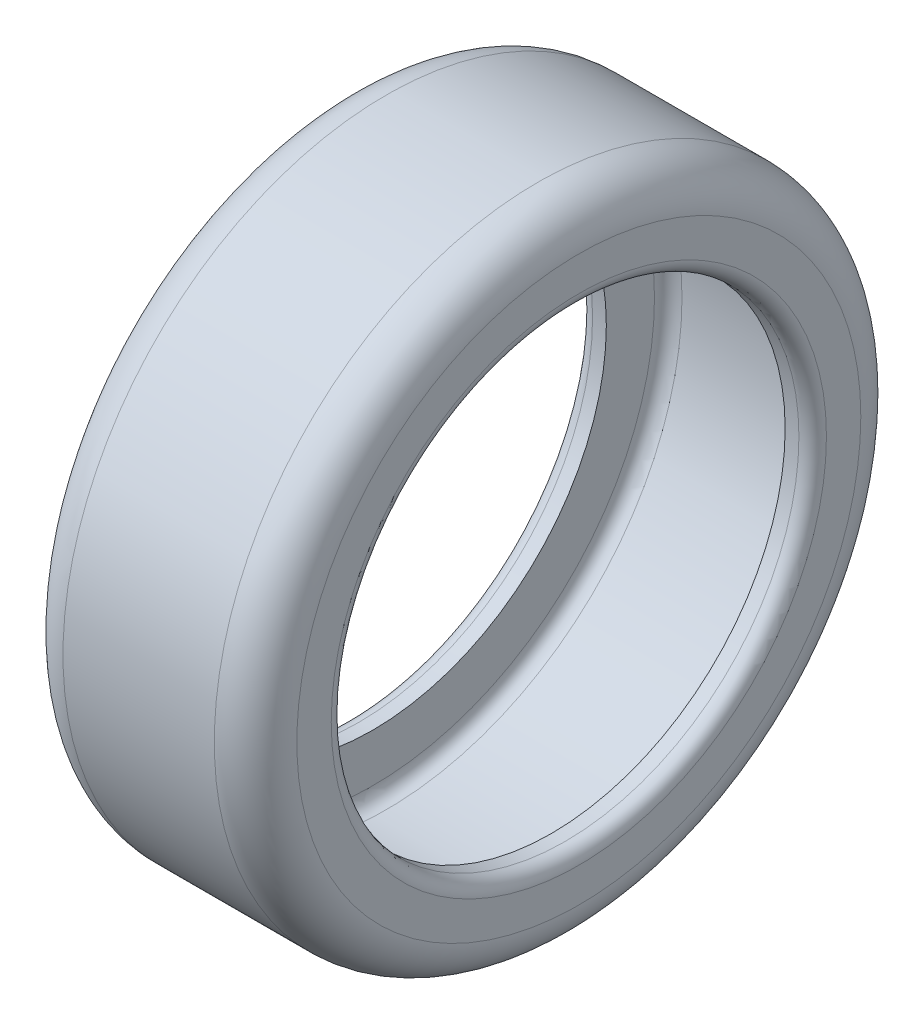
ISO-10303-21;
HEADER;
FILE_DESCRIPTION(('STEP AP214'),'2;1');
FILE_NAME('part.step','',(''),(''),'','','');
FILE_SCHEMA(('AUTOMOTIVE_DESIGN { 1 0 10303 214 1 1 1 1 }'));
ENDSEC;
DATA;
#1=APPLICATION_CONTEXT('core data for automotive mechanical design processes');
#2=APPLICATION_PROTOCOL_DEFINITION('international standard','automotive_design',2000,#1);
#3=PRODUCT_CONTEXT('',#1,'mechanical');
#4=PRODUCT('Part','Part','',(#3));
#5=PRODUCT_RELATED_PRODUCT_CATEGORY('part','',(#4));
#6=PRODUCT_DEFINITION_FORMATION('','',#4);
#7=PRODUCT_DEFINITION_CONTEXT('part definition',#1,'design');
#8=PRODUCT_DEFINITION('design','',#6,#7);
#9=PRODUCT_DEFINITION_SHAPE('','',#8);
#10=(LENGTH_UNIT() NAMED_UNIT(*) SI_UNIT(.MILLI.,.METRE.));
#11=(NAMED_UNIT(*) PLANE_ANGLE_UNIT() SI_UNIT($,.RADIAN.));
#12=(NAMED_UNIT(*) SI_UNIT($,.STERADIAN.) SOLID_ANGLE_UNIT());
#13=UNCERTAINTY_MEASURE_WITH_UNIT(LENGTH_MEASURE(1.E-05),#10,'distance_accuracy_value','');
#14=(GEOMETRIC_REPRESENTATION_CONTEXT(3) GLOBAL_UNCERTAINTY_ASSIGNED_CONTEXT((#13)) GLOBAL_UNIT_ASSIGNED_CONTEXT((#10,
#11,#12)) REPRESENTATION_CONTEXT('',''));
#15=CARTESIAN_POINT('',(0.,0.,0.));
#16=DIRECTION('',(0.,0.,1.));
#17=DIRECTION('',(1.,0.,0.));
#18=AXIS2_PLACEMENT_3D('',#15,#16,#17);
#19=CARTESIAN_POINT('',(17.,0.,0.));
#20=DIRECTION('',(-1.,0.,0.));
#21=DIRECTION('',(0.,0.,1.));
#22=AXIS2_PLACEMENT_3D('',#19,#20,#21);
#23=CYLINDRICAL_SURFACE('',#22,17.);
#24=CARTESIAN_POINT('',(16.,0.,0.));
#25=DIRECTION('',(1.,0.,0.));
#26=DIRECTION('',(0.,0.,-1.));
#27=AXIS2_PLACEMENT_3D('',#24,#25,#26);
#28=CIRCLE('',#27,17.);
#29=CARTESIAN_POINT('',(16.,0.,-17.));
#30=VERTEX_POINT('',#29);
#31=EDGE_CURVE('E44',#30,#30,#28,.T.);
#32=ORIENTED_EDGE('',*,*,#31,.T.);
#33=EDGE_LOOP('',(#32));
#34=FACE_BOUND('',#33,.T.);
#35=CARTESIAN_POINT('',(15.,0.,0.));
#36=DIRECTION('',(1.,0.,0.));
#37=DIRECTION('',(0.,0.,-1.));
#38=AXIS2_PLACEMENT_3D('',#35,#36,#37);
#39=CIRCLE('',#38,17.);
#40=CARTESIAN_POINT('',(15.,0.,-17.));
#41=VERTEX_POINT('',#40);
#42=EDGE_CURVE('E68',#41,#41,#39,.F.);
#43=ORIENTED_EDGE('',*,*,#42,.T.);
#44=EDGE_LOOP('',(#43));
#45=FACE_BOUND('',#44,.T.);
#46=ADVANCED_FACE('F33',(#34,#45),#23,.F.);
#47=CARTESIAN_POINT('',(17.,0.,0.));
#48=DIRECTION('',(1.,0.,0.));
#49=DIRECTION('',(0.,0.,-1.));
#50=AXIS2_PLACEMENT_3D('',#47,#48,#49);
#51=PLANE('',#50);
#52=CARTESIAN_POINT('',(17.,0.,0.));
#53=DIRECTION('',(1.,0.,0.));
#54=DIRECTION('',(0.,0.,-1.));
#55=AXIS2_PLACEMENT_3D('',#52,#53,#54);
#56=CIRCLE('',#55,18.);
#57=CARTESIAN_POINT('',(17.,0.,-18.));
#58=VERTEX_POINT('',#57);
#59=EDGE_CURVE('E10',#58,#58,#56,.F.);
#60=ORIENTED_EDGE('',*,*,#59,.T.);
#61=EDGE_LOOP('',(#60));
#62=FACE_BOUND('',#61,.T.);
#63=CARTESIAN_POINT('',(17.,0.,0.));
#64=DIRECTION('',(1.,0.,0.));
#65=DIRECTION('',(0.,0.,-1.));
#66=AXIS2_PLACEMENT_3D('',#63,#64,#65);
#67=CIRCLE('',#66,20.5);
#68=CARTESIAN_POINT('',(17.,0.,-20.5));
#69=VERTEX_POINT('',#68);
#70=EDGE_CURVE('E53',#69,#69,#67,.T.);
#71=ORIENTED_EDGE('',*,*,#70,.T.);
#72=EDGE_LOOP('',(#71));
#73=FACE_BOUND('',#72,.T.);
#74=ADVANCED_FACE('F94',(#62,#73),#51,.T.);
#75=CARTESIAN_POINT('',(0.,0.,0.));
#76=DIRECTION('',(1.,0.,0.));
#77=DIRECTION('',(0.,0.,-1.));
#78=AXIS2_PLACEMENT_3D('',#75,#76,#77);
#79=PLANE('',#78);
#80=CARTESIAN_POINT('',(0.,0.,0.));
#81=DIRECTION('',(1.,0.,0.));
#82=DIRECTION('',(0.,0.,-1.));
#83=AXIS2_PLACEMENT_3D('',#80,#81,#82);
#84=CIRCLE('',#83,18.);
#85=CARTESIAN_POINT('',(0.,0.,-18.));
#86=VERTEX_POINT('',#85);
#87=EDGE_CURVE('E48',#86,#86,#84,.T.);
#88=ORIENTED_EDGE('',*,*,#87,.T.);
#89=EDGE_LOOP('',(#88));
#90=FACE_BOUND('',#89,.T.);
#91=CARTESIAN_POINT('',(0.,0.,0.));
#92=DIRECTION('',(1.,0.,0.));
#93=DIRECTION('',(0.,0.,-1.));
#94=AXIS2_PLACEMENT_3D('',#91,#92,#93);
#95=CIRCLE('',#94,20.5);
#96=CARTESIAN_POINT('',(0.,0.,-20.5));
#97=VERTEX_POINT('',#96);
#98=EDGE_CURVE('E56',#97,#97,#95,.F.);
#99=ORIENTED_EDGE('',*,*,#98,.T.);
#100=EDGE_LOOP('',(#99));
#101=FACE_BOUND('',#100,.T.);
#102=ADVANCED_FACE('F101',(#90,#101),#79,.F.);
#103=CARTESIAN_POINT('',(17.,0.,0.));
#104=DIRECTION('',(-1.,0.,0.));
#105=DIRECTION('',(0.,0.,1.));
#106=AXIS2_PLACEMENT_3D('',#103,#104,#105);
#107=CYLINDRICAL_SURFACE('',#106,23.5);
#108=CARTESIAN_POINT('',(3.,0.,0.));
#109=DIRECTION('',(1.,0.,0.));
#110=DIRECTION('',(0.,0.,-1.));
#111=AXIS2_PLACEMENT_3D('',#108,#109,#110);
#112=CIRCLE('',#111,23.5);
#113=CARTESIAN_POINT('',(3.,0.,-23.5));
#114=VERTEX_POINT('',#113);
#115=EDGE_CURVE('E59',#114,#114,#112,.T.);
#116=ORIENTED_EDGE('',*,*,#115,.T.);
#117=EDGE_LOOP('',(#116));
#118=FACE_BOUND('',#117,.T.);
#119=CARTESIAN_POINT('',(14.,0.,0.));
#120=DIRECTION('',(1.,0.,0.));
#121=DIRECTION('',(0.,0.,-1.));
#122=AXIS2_PLACEMENT_3D('',#119,#120,#121);
#123=CIRCLE('',#122,23.5);
#124=CARTESIAN_POINT('',(14.,0.,-23.5));
#125=VERTEX_POINT('',#124);
#126=EDGE_CURVE('E62',#125,#125,#123,.F.);
#127=ORIENTED_EDGE('',*,*,#126,.T.);
#128=EDGE_LOOP('',(#127));
#129=FACE_BOUND('',#128,.T.);
#130=ADVANCED_FACE('F106',(#118,#129),#107,.T.);
#131=CARTESIAN_POINT('',(2.,0.,0.));
#132=DIRECTION('',(1.,0.,0.));
#133=DIRECTION('',(0.,0.,-1.));
#134=AXIS2_PLACEMENT_3D('',#131,#132,#133);
#135=CIRCLE('',#134,17.);
#136=CARTESIAN_POINT('',(2.,0.,-17.));
#137=VERTEX_POINT('',#136);
#138=EDGE_CURVE('E65',#137,#137,#135,.F.);
#139=ORIENTED_EDGE('',*,*,#138,.F.);
#140=EDGE_LOOP('',(#139));
#141=FACE_BOUND('',#140,.T.);
#142=CARTESIAN_POINT('',(1.,0.,0.));
#143=DIRECTION('',(1.,0.,0.));
#144=DIRECTION('',(0.,0.,-1.));
#145=AXIS2_PLACEMENT_3D('',#142,#143,#144);
#146=CIRCLE('',#145,17.);
#147=CARTESIAN_POINT('',(1.,0.,-17.));
#148=VERTEX_POINT('',#147);
#149=EDGE_CURVE('E40',#148,#148,#146,.F.);
#150=ORIENTED_EDGE('',*,*,#149,.T.);
#151=EDGE_LOOP('',(#150));
#152=FACE_BOUND('',#151,.T.);
#153=ADVANCED_FACE('F97',(#141,#152),#23,.F.);
#154=CARTESIAN_POINT('',(3.,0.,0.));
#155=DIRECTION('',(1.,0.,0.));
#156=DIRECTION('',(0.,0.,-1.));
#157=AXIS2_PLACEMENT_3D('',#154,#155,#156);
#158=TOROIDAL_SURFACE('',#157,20.5,3.);
#159=ORIENTED_EDGE('',*,*,#98,.F.);
#160=EDGE_LOOP('',(#159));
#161=FACE_BOUND('',#160,.T.);
#162=ORIENTED_EDGE('',*,*,#115,.F.);
#163=EDGE_LOOP('',(#162));
#164=FACE_BOUND('',#163,.T.);
#165=ADVANCED_FACE('F105',(#161,#164),#158,.T.);
#166=CARTESIAN_POINT('',(14.,0.,0.));
#167=DIRECTION('',(1.,0.,0.));
#168=DIRECTION('',(0.,0.,-1.));
#169=AXIS2_PLACEMENT_3D('',#166,#167,#168);
#170=TOROIDAL_SURFACE('',#169,20.5,3.);
#171=ORIENTED_EDGE('',*,*,#126,.F.);
#172=EDGE_LOOP('',(#171));
#173=FACE_BOUND('',#172,.T.);
#174=ORIENTED_EDGE('',*,*,#70,.F.);
#175=EDGE_LOOP('',(#174));
#176=FACE_BOUND('',#175,.T.);
#177=ADVANCED_FACE('F112',(#173,#176),#170,.T.);
#178=CARTESIAN_POINT('',(1.,0.,0.));
#179=DIRECTION('',(1.,0.,0.));
#180=DIRECTION('',(0.,0.,-1.));
#181=AXIS2_PLACEMENT_3D('',#178,#179,#180);
#182=TOROIDAL_SURFACE('',#181,18.,1.);
#183=ORIENTED_EDGE('',*,*,#149,.F.);
#184=EDGE_LOOP('',(#183));
#185=FACE_BOUND('',#184,.T.);
#186=ORIENTED_EDGE('',*,*,#87,.F.);
#187=EDGE_LOOP('',(#186));
#188=FACE_BOUND('',#187,.T.);
#189=ADVANCED_FACE('F159',(#185,#188),#182,.T.);
#190=CARTESIAN_POINT('',(16.,0.,0.));
#191=DIRECTION('',(1.,0.,0.));
#192=DIRECTION('',(0.,0.,-1.));
#193=AXIS2_PLACEMENT_3D('',#190,#191,#192);
#194=TOROIDAL_SURFACE('',#193,18.,1.);
#195=ORIENTED_EDGE('',*,*,#59,.F.);
#196=EDGE_LOOP('',(#195));
#197=FACE_BOUND('',#196,.T.);
#198=ORIENTED_EDGE('',*,*,#31,.F.);
#199=EDGE_LOOP('',(#198));
#200=FACE_BOUND('',#199,.T.);
#201=ADVANCED_FACE('F35',(#197,#200),#194,.T.);
#202=CARTESIAN_POINT('',(15.,0.,0.));
#203=DIRECTION('',(1.,0.,0.));
#204=DIRECTION('',(0.,0.,-1.));
#205=AXIS2_PLACEMENT_3D('',#202,#203,#204);
#206=PLANE('',#205);
#207=CARTESIAN_POINT('',(15.,0.,0.));
#208=DIRECTION('',(1.,0.,0.));
#209=DIRECTION('',(0.,0.,-1.));
#210=AXIS2_PLACEMENT_3D('',#207,#208,#209);
#211=CIRCLE('',#210,20.5);
#212=CARTESIAN_POINT('',(15.,0.,-20.5));
#213=VERTEX_POINT('',#212);
#214=EDGE_CURVE('E71',#213,#213,#211,.T.);
#215=ORIENTED_EDGE('',*,*,#214,.F.);
#216=EDGE_LOOP('',(#215));
#217=FACE_BOUND('',#216,.T.);
#218=ORIENTED_EDGE('',*,*,#42,.F.);
#219=EDGE_LOOP('',(#218));
#220=FACE_BOUND('',#219,.T.);
#221=ADVANCED_FACE('F86',(#217,#220),#206,.F.);
#222=CARTESIAN_POINT('',(2.,0.,0.));
#223=DIRECTION('',(1.,0.,0.));
#224=DIRECTION('',(0.,0.,-1.));
#225=AXIS2_PLACEMENT_3D('',#222,#223,#224);
#226=PLANE('',#225);
#227=CARTESIAN_POINT('',(2.,0.,0.));
#228=DIRECTION('',(1.,0.,0.));
#229=DIRECTION('',(0.,0.,-1.));
#230=AXIS2_PLACEMENT_3D('',#227,#228,#229);
#231=CIRCLE('',#230,20.5);
#232=CARTESIAN_POINT('',(2.,0.,-20.5));
#233=VERTEX_POINT('',#232);
#234=EDGE_CURVE('E72',#233,#233,#231,.F.);
#235=ORIENTED_EDGE('',*,*,#234,.F.);
#236=EDGE_LOOP('',(#235));
#237=FACE_BOUND('',#236,.T.);
#238=ORIENTED_EDGE('',*,*,#138,.T.);
#239=EDGE_LOOP('',(#238));
#240=FACE_BOUND('',#239,.T.);
#241=ADVANCED_FACE('F89',(#237,#240),#226,.T.);
#242=CARTESIAN_POINT('',(17.,0.,0.));
#243=DIRECTION('',(-1.,0.,0.));
#244=DIRECTION('',(0.,0.,1.));
#245=AXIS2_PLACEMENT_3D('',#242,#243,#244);
#246=CYLINDRICAL_SURFACE('',#245,21.5);
#247=CARTESIAN_POINT('',(3.,0.,0.));
#248=DIRECTION('',(-1.,0.,0.));
#249=DIRECTION('',(0.,0.,1.));
#250=AXIS2_PLACEMENT_3D('',#247,#248,#249);
#251=CIRCLE('',#250,21.5);
#252=CARTESIAN_POINT('',(3.,0.,21.5));
#253=VERTEX_POINT('',#252);
#254=EDGE_CURVE('E75',#253,#253,#251,.F.);
#255=ORIENTED_EDGE('',*,*,#254,.F.);
#256=EDGE_LOOP('',(#255));
#257=FACE_BOUND('',#256,.T.);
#258=CARTESIAN_POINT('',(14.,0.,0.));
#259=DIRECTION('',(-1.,0.,0.));
#260=DIRECTION('',(0.,0.,1.));
#261=AXIS2_PLACEMENT_3D('',#258,#259,#260);
#262=CIRCLE('',#261,21.5);
#263=CARTESIAN_POINT('',(14.,0.,21.5));
#264=VERTEX_POINT('',#263);
#265=EDGE_CURVE('E78',#264,#264,#262,.T.);
#266=ORIENTED_EDGE('',*,*,#265,.F.);
#267=EDGE_LOOP('',(#266));
#268=FACE_BOUND('',#267,.T.);
#269=ADVANCED_FACE('F120',(#257,#268),#246,.F.);
#270=CARTESIAN_POINT('',(3.,0.,0.));
#271=DIRECTION('',(1.,0.,0.));
#272=DIRECTION('',(0.,0.,-1.));
#273=AXIS2_PLACEMENT_3D('',#270,#271,#272);
#274=TOROIDAL_SURFACE('',#273,20.5,1.);
#275=ORIENTED_EDGE('',*,*,#234,.T.);
#276=EDGE_LOOP('',(#275));
#277=FACE_BOUND('',#276,.T.);
#278=ORIENTED_EDGE('',*,*,#254,.T.);
#279=EDGE_LOOP('',(#278));
#280=FACE_BOUND('',#279,.T.);
#281=ADVANCED_FACE('F126',(#277,#280),#274,.F.);
#282=CARTESIAN_POINT('',(14.,0.,0.));
#283=DIRECTION('',(1.,0.,0.));
#284=DIRECTION('',(0.,0.,-1.));
#285=AXIS2_PLACEMENT_3D('',#282,#283,#284);
#286=TOROIDAL_SURFACE('',#285,20.5,1.);
#287=ORIENTED_EDGE('',*,*,#265,.T.);
#288=EDGE_LOOP('',(#287));
#289=FACE_BOUND('',#288,.T.);
#290=ORIENTED_EDGE('',*,*,#214,.T.);
#291=EDGE_LOOP('',(#290));
#292=FACE_BOUND('',#291,.T.);
#293=ADVANCED_FACE('F84',(#289,#292),#286,.F.);
#294=CLOSED_SHELL('',(#46,#74,#102,#130,#153,#165,#177,#189,#201,#221,#241,#269,#281,#293));
#295=MANIFOLD_SOLID_BREP('B2',#294);
#296=ADVANCED_BREP_SHAPE_REPRESENTATION('',(#18,#295),#14);
#297=SHAPE_DEFINITION_REPRESENTATION(#9,#296);
ENDSEC;
END-ISO-10303-21;
